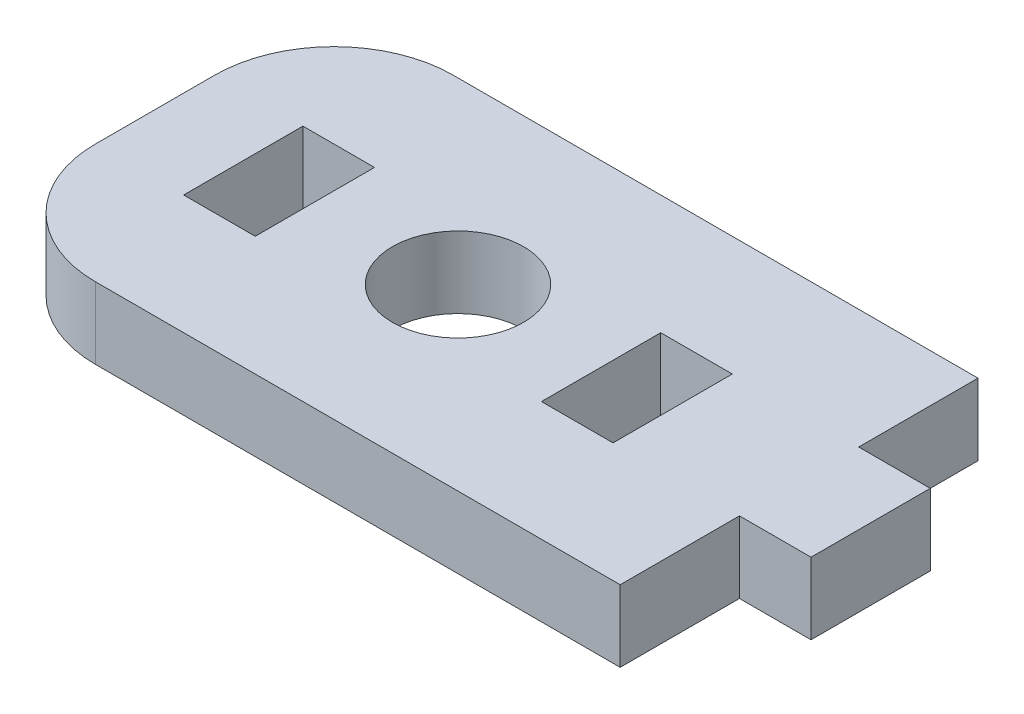
ISO-10303-21;
HEADER;
FILE_DESCRIPTION(('STEP AP214'),'2;1');
FILE_NAME('part.step','',(''),(''),'','','');
FILE_SCHEMA(('AUTOMOTIVE_DESIGN { 1 0 10303 214 1 1 1 1 }'));
ENDSEC;
DATA;
#1=APPLICATION_CONTEXT('core data for automotive mechanical design processes');
#2=APPLICATION_PROTOCOL_DEFINITION('international standard','automotive_design',2000,#1);
#3=PRODUCT_CONTEXT('',#1,'mechanical');
#4=PRODUCT('Part','Part','',(#3));
#5=PRODUCT_RELATED_PRODUCT_CATEGORY('part','',(#4));
#6=PRODUCT_DEFINITION_FORMATION('','',#4);
#7=PRODUCT_DEFINITION_CONTEXT('part definition',#1,'design');
#8=PRODUCT_DEFINITION('design','',#6,#7);
#9=PRODUCT_DEFINITION_SHAPE('','',#8);
#10=(LENGTH_UNIT() NAMED_UNIT(*) SI_UNIT(.MILLI.,.METRE.));
#11=(NAMED_UNIT(*) PLANE_ANGLE_UNIT() SI_UNIT($,.RADIAN.));
#12=(NAMED_UNIT(*) SI_UNIT($,.STERADIAN.) SOLID_ANGLE_UNIT());
#13=UNCERTAINTY_MEASURE_WITH_UNIT(LENGTH_MEASURE(1.E-05),#10,'distance_accuracy_value','');
#14=(GEOMETRIC_REPRESENTATION_CONTEXT(3) GLOBAL_UNCERTAINTY_ASSIGNED_CONTEXT((#13)) GLOBAL_UNIT_ASSIGNED_CONTEXT((#10,
#11,#12)) REPRESENTATION_CONTEXT('',''));
#15=CARTESIAN_POINT('',(0.,0.,0.));
#16=DIRECTION('',(0.,0.,1.));
#17=DIRECTION('',(1.,0.,0.));
#18=AXIS2_PLACEMENT_3D('',#15,#16,#17);
#19=CARTESIAN_POINT('',(0.,3.,0.));
#20=DIRECTION('',(0.,-1.,0.));
#21=DIRECTION('',(0.,0.,-1.));
#22=AXIS2_PLACEMENT_3D('',#19,#20,#21);
#23=PLANE('',#22);
#24=CARTESIAN_POINT('',(-9.12159290101671,3.,-2.5));
#25=DIRECTION('',(0.,1.,0.));
#26=DIRECTION('',(0.,0.,1.));
#27=AXIS2_PLACEMENT_3D('',#24,#25,#26);
#28=CIRCLE('',#27,2.75);
#29=CARTESIAN_POINT('',(-9.12159290101671,3.,0.249999999999998));
#30=VERTEX_POINT('',#29);
#31=EDGE_CURVE('E202',#30,#30,#28,.T.);
#32=ORIENTED_EDGE('',*,*,#31,.F.);
#33=EDGE_LOOP('',(#32));
#34=FACE_BOUND('',#33,.T.);
#35=DIRECTION('',(0.,0.,1.));
#36=VECTOR('',#35,1.);
#37=CARTESIAN_POINT('',(-21.8215929010167,3.,5.));
#38=LINE('',#37,#36);
#39=CARTESIAN_POINT('',(-21.8215929010167,3.,-5.));
#40=VERTEX_POINT('',#39);
#41=CARTESIAN_POINT('',(-21.8215929010167,3.,0.));
#42=VERTEX_POINT('',#41);
#43=EDGE_CURVE('E254',#40,#42,#38,.T.);
#44=ORIENTED_EDGE('',*,*,#43,.T.);
#45=CARTESIAN_POINT('',(-16.8215929010167,3.,0.));
#46=DIRECTION('',(0.,-1.,0.));
#47=DIRECTION('',(0.,0.,-1.));
#48=AXIS2_PLACEMENT_3D('',#45,#46,#47);
#49=CIRCLE('',#48,5.);
#50=CARTESIAN_POINT('',(-16.8215929010167,3.,5.));
#51=VERTEX_POINT('',#50);
#52=EDGE_CURVE('E41',#42,#51,#49,.F.);
#53=ORIENTED_EDGE('',*,*,#52,.T.);
#54=DIRECTION('',(1.,0.,0.));
#55=VECTOR('',#54,1.);
#56=CARTESIAN_POINT('',(5.17840709898329,3.,5.));
#57=LINE('',#56,#55);
#58=CARTESIAN_POINT('',(5.17840709898329,3.,5.));
#59=VERTEX_POINT('',#58);
#60=EDGE_CURVE('E239',#51,#59,#57,.T.);
#61=ORIENTED_EDGE('',*,*,#60,.T.);
#62=DIRECTION('',(0.,0.,-1.));
#63=VECTOR('',#62,1.);
#64=CARTESIAN_POINT('',(5.17840709898329,3.,0.));
#65=LINE('',#64,#63);
#66=CARTESIAN_POINT('',(5.17840709898329,3.,0.));
#67=VERTEX_POINT('',#66);
#68=EDGE_CURVE('E241',#59,#67,#65,.T.);
#69=ORIENTED_EDGE('',*,*,#68,.T.);
#70=DIRECTION('',(1.,0.,0.));
#71=VECTOR('',#70,1.);
#72=CARTESIAN_POINT('',(8.17840709898329,3.,0.));
#73=LINE('',#72,#71);
#74=CARTESIAN_POINT('',(8.17840709898329,3.,0.));
#75=VERTEX_POINT('',#74);
#76=EDGE_CURVE('E244',#67,#75,#73,.T.);
#77=ORIENTED_EDGE('',*,*,#76,.T.);
#78=DIRECTION('',(0.,0.,-1.));
#79=VECTOR('',#78,1.);
#80=CARTESIAN_POINT('',(8.17840709898329,3.,-5.));
#81=LINE('',#80,#79);
#82=CARTESIAN_POINT('',(8.17840709898329,3.,-5.));
#83=VERTEX_POINT('',#82);
#84=EDGE_CURVE('E246',#75,#83,#81,.T.);
#85=ORIENTED_EDGE('',*,*,#84,.T.);
#86=DIRECTION('',(-1.,0.,0.));
#87=VECTOR('',#86,1.);
#88=CARTESIAN_POINT('',(5.17840709898329,3.,-5.));
#89=LINE('',#88,#87);
#90=CARTESIAN_POINT('',(5.17840709898329,3.,-5.));
#91=VERTEX_POINT('',#90);
#92=EDGE_CURVE('E248',#83,#91,#89,.T.);
#93=ORIENTED_EDGE('',*,*,#92,.T.);
#94=DIRECTION('',(0.,0.,-1.));
#95=VECTOR('',#94,1.);
#96=CARTESIAN_POINT('',(5.17840709898329,3.,-10.));
#97=LINE('',#96,#95);
#98=CARTESIAN_POINT('',(5.17840709898329,3.,-10.));
#99=VERTEX_POINT('',#98);
#100=EDGE_CURVE('E250',#91,#99,#97,.T.);
#101=ORIENTED_EDGE('',*,*,#100,.T.);
#102=DIRECTION('',(-1.,0.,0.));
#103=VECTOR('',#102,1.);
#104=CARTESIAN_POINT('',(-21.8215929010167,3.,-10.));
#105=LINE('',#104,#103);
#106=CARTESIAN_POINT('',(-16.8215929010167,3.,-10.));
#107=VERTEX_POINT('',#106);
#108=EDGE_CURVE('E252',#99,#107,#105,.T.);
#109=ORIENTED_EDGE('',*,*,#108,.T.);
#110=CARTESIAN_POINT('',(-16.8215929010167,3.,-5.));
#111=DIRECTION('',(0.,-1.,0.));
#112=DIRECTION('',(0.,0.,-1.));
#113=AXIS2_PLACEMENT_3D('',#110,#111,#112);
#114=CIRCLE('',#113,5.);
#115=EDGE_CURVE('E299',#107,#40,#114,.F.);
#116=ORIENTED_EDGE('',*,*,#115,.T.);
#117=EDGE_LOOP('',(#44,#53,#61,#69,#77,#85,#93,#101,#109,#116));
#118=FACE_BOUND('',#117,.T.);
#119=DIRECTION('',(0.,0.,1.));
#120=VECTOR('',#119,1.);
#121=CARTESIAN_POINT('',(-18.1215929010167,3.,-5.));
#122=LINE('',#121,#120);
#123=CARTESIAN_POINT('',(-18.1215929010167,3.,-5.));
#124=VERTEX_POINT('',#123);
#125=CARTESIAN_POINT('',(-18.1215929010167,3.,0.));
#126=VERTEX_POINT('',#125);
#127=EDGE_CURVE('E208',#124,#126,#122,.T.);
#128=ORIENTED_EDGE('',*,*,#127,.F.);
#129=DIRECTION('',(-1.,0.,0.));
#130=VECTOR('',#129,1.);
#131=CARTESIAN_POINT('',(-15.1215929010167,3.,-5.));
#132=LINE('',#131,#130);
#133=CARTESIAN_POINT('',(-15.1215929010167,3.,-5.));
#134=VERTEX_POINT('',#133);
#135=EDGE_CURVE('E216',#134,#124,#132,.T.);
#136=ORIENTED_EDGE('',*,*,#135,.F.);
#137=DIRECTION('',(0.,0.,-1.));
#138=VECTOR('',#137,1.);
#139=CARTESIAN_POINT('',(-15.1215929010167,3.,-5.));
#140=LINE('',#139,#138);
#141=CARTESIAN_POINT('',(-15.1215929010167,3.,0.));
#142=VERTEX_POINT('',#141);
#143=EDGE_CURVE('E213',#142,#134,#140,.T.);
#144=ORIENTED_EDGE('',*,*,#143,.F.);
#145=DIRECTION('',(1.,0.,0.));
#146=VECTOR('',#145,1.);
#147=CARTESIAN_POINT('',(-15.1215929010167,3.,0.));
#148=LINE('',#147,#146);
#149=EDGE_CURVE('E210',#126,#142,#148,.T.);
#150=ORIENTED_EDGE('',*,*,#149,.F.);
#151=EDGE_LOOP('',(#128,#136,#144,#150));
#152=FACE_BOUND('',#151,.T.);
#153=DIRECTION('',(0.,0.,1.));
#154=VECTOR('',#153,1.);
#155=CARTESIAN_POINT('',(-3.12159290101671,3.,-5.));
#156=LINE('',#155,#154);
#157=CARTESIAN_POINT('',(-3.12159290101671,3.,-5.));
#158=VERTEX_POINT('',#157);
#159=CARTESIAN_POINT('',(-3.12159290101671,3.,0.));
#160=VERTEX_POINT('',#159);
#161=EDGE_CURVE('E161',#158,#160,#156,.T.);
#162=ORIENTED_EDGE('',*,*,#161,.F.);
#163=DIRECTION('',(-1.,0.,0.));
#164=VECTOR('',#163,1.);
#165=CARTESIAN_POINT('',(-3.12159290101671,3.,-5.));
#166=LINE('',#165,#164);
#167=CARTESIAN_POINT('',(-0.121592901016709,3.,-5.));
#168=VERTEX_POINT('',#167);
#169=EDGE_CURVE('E186',#168,#158,#166,.T.);
#170=ORIENTED_EDGE('',*,*,#169,.F.);
#171=DIRECTION('',(0.,0.,-1.));
#172=VECTOR('',#171,1.);
#173=CARTESIAN_POINT('',(-0.121592901016709,3.,-5.));
#174=LINE('',#173,#172);
#175=CARTESIAN_POINT('',(-0.121592901016709,3.,0.));
#176=VERTEX_POINT('',#175);
#177=EDGE_CURVE('E184',#176,#168,#174,.T.);
#178=ORIENTED_EDGE('',*,*,#177,.F.);
#179=DIRECTION('',(1.,0.,0.));
#180=VECTOR('',#179,1.);
#181=CARTESIAN_POINT('',(-3.12159290101671,3.,0.));
#182=LINE('',#181,#180);
#183=EDGE_CURVE('E171',#160,#176,#182,.T.);
#184=ORIENTED_EDGE('',*,*,#183,.F.);
#185=EDGE_LOOP('',(#162,#170,#178,#184));
#186=FACE_BOUND('',#185,.T.);
#187=ADVANCED_FACE('F33',(#34,#118,#152,#186),#23,.F.);
#188=CARTESIAN_POINT('',(0.,0.,0.));
#189=DIRECTION('',(0.,-1.,0.));
#190=DIRECTION('',(0.,0.,-1.));
#191=AXIS2_PLACEMENT_3D('',#188,#189,#190);
#192=PLANE('',#191);
#193=CARTESIAN_POINT('',(-9.12159290101671,0.,-2.5));
#194=DIRECTION('',(0.,1.,0.));
#195=DIRECTION('',(0.,0.,1.));
#196=AXIS2_PLACEMENT_3D('',#193,#194,#195);
#197=CIRCLE('',#196,2.75);
#198=CARTESIAN_POINT('',(-9.12159290101671,0.,0.249999999999998));
#199=VERTEX_POINT('',#198);
#200=EDGE_CURVE('E179',#199,#199,#197,.T.);
#201=ORIENTED_EDGE('',*,*,#200,.T.);
#202=EDGE_LOOP('',(#201));
#203=FACE_BOUND('',#202,.T.);
#204=DIRECTION('',(1.,0.,0.));
#205=VECTOR('',#204,1.);
#206=CARTESIAN_POINT('',(5.17840709898329,0.,5.));
#207=LINE('',#206,#205);
#208=CARTESIAN_POINT('',(-16.8215929010167,0.,5.));
#209=VERTEX_POINT('',#208);
#210=CARTESIAN_POINT('',(5.17840709898329,0.,5.));
#211=VERTEX_POINT('',#210);
#212=EDGE_CURVE('E238',#209,#211,#207,.T.);
#213=ORIENTED_EDGE('',*,*,#212,.F.);
#214=CARTESIAN_POINT('',(-16.8215929010167,0.,0.));
#215=DIRECTION('',(0.,-1.,0.));
#216=DIRECTION('',(0.,0.,-1.));
#217=AXIS2_PLACEMENT_3D('',#214,#215,#216);
#218=CIRCLE('',#217,5.);
#219=CARTESIAN_POINT('',(-21.8215929010167,0.,0.));
#220=VERTEX_POINT('',#219);
#221=EDGE_CURVE('E293',#209,#220,#218,.T.);
#222=ORIENTED_EDGE('',*,*,#221,.T.);
#223=DIRECTION('',(0.,0.,1.));
#224=VECTOR('',#223,1.);
#225=CARTESIAN_POINT('',(-21.8215929010167,0.,5.));
#226=LINE('',#225,#224);
#227=CARTESIAN_POINT('',(-21.8215929010167,0.,-5.));
#228=VERTEX_POINT('',#227);
#229=EDGE_CURVE('E242',#228,#220,#226,.T.);
#230=ORIENTED_EDGE('',*,*,#229,.F.);
#231=CARTESIAN_POINT('',(-16.8215929010167,0.,-5.));
#232=DIRECTION('',(0.,-1.,0.));
#233=DIRECTION('',(0.,0.,-1.));
#234=AXIS2_PLACEMENT_3D('',#231,#232,#233);
#235=CIRCLE('',#234,5.);
#236=CARTESIAN_POINT('',(-16.8215929010167,0.,-10.));
#237=VERTEX_POINT('',#236);
#238=EDGE_CURVE('E291',#228,#237,#235,.T.);
#239=ORIENTED_EDGE('',*,*,#238,.T.);
#240=DIRECTION('',(-1.,0.,0.));
#241=VECTOR('',#240,1.);
#242=CARTESIAN_POINT('',(-21.8215929010167,0.,-10.));
#243=LINE('',#242,#241);
#244=CARTESIAN_POINT('',(5.17840709898329,0.,-10.));
#245=VERTEX_POINT('',#244);
#246=EDGE_CURVE('E268',#245,#237,#243,.T.);
#247=ORIENTED_EDGE('',*,*,#246,.F.);
#248=DIRECTION('',(0.,0.,-1.));
#249=VECTOR('',#248,1.);
#250=CARTESIAN_POINT('',(5.17840709898329,0.,-10.));
#251=LINE('',#250,#249);
#252=CARTESIAN_POINT('',(5.17840709898329,0.,-5.));
#253=VERTEX_POINT('',#252);
#254=EDGE_CURVE('E266',#253,#245,#251,.T.);
#255=ORIENTED_EDGE('',*,*,#254,.F.);
#256=DIRECTION('',(-1.,0.,0.));
#257=VECTOR('',#256,1.);
#258=CARTESIAN_POINT('',(5.17840709898329,0.,-5.));
#259=LINE('',#258,#257);
#260=CARTESIAN_POINT('',(8.17840709898329,0.,-5.));
#261=VERTEX_POINT('',#260);
#262=EDGE_CURVE('E264',#261,#253,#259,.T.);
#263=ORIENTED_EDGE('',*,*,#262,.F.);
#264=DIRECTION('',(0.,0.,-1.));
#265=VECTOR('',#264,1.);
#266=CARTESIAN_POINT('',(8.17840709898329,0.,-5.));
#267=LINE('',#266,#265);
#268=CARTESIAN_POINT('',(8.17840709898329,0.,0.));
#269=VERTEX_POINT('',#268);
#270=EDGE_CURVE('E262',#269,#261,#267,.T.);
#271=ORIENTED_EDGE('',*,*,#270,.F.);
#272=DIRECTION('',(1.,0.,0.));
#273=VECTOR('',#272,1.);
#274=CARTESIAN_POINT('',(8.17840709898329,0.,0.));
#275=LINE('',#274,#273);
#276=CARTESIAN_POINT('',(5.17840709898329,0.,0.));
#277=VERTEX_POINT('',#276);
#278=EDGE_CURVE('E260',#277,#269,#275,.T.);
#279=ORIENTED_EDGE('',*,*,#278,.F.);
#280=DIRECTION('',(0.,0.,-1.));
#281=VECTOR('',#280,1.);
#282=CARTESIAN_POINT('',(5.17840709898329,0.,0.));
#283=LINE('',#282,#281);
#284=EDGE_CURVE('E258',#211,#277,#283,.T.);
#285=ORIENTED_EDGE('',*,*,#284,.F.);
#286=EDGE_LOOP('',(#213,#222,#230,#239,#247,#255,#263,#271,#279,#285));
#287=FACE_BOUND('',#286,.T.);
#288=DIRECTION('',(-1.,0.,0.));
#289=VECTOR('',#288,1.);
#290=CARTESIAN_POINT('',(-15.1215929010167,0.,-5.));
#291=LINE('',#290,#289);
#292=CARTESIAN_POINT('',(-15.1215929010167,0.,-5.));
#293=VERTEX_POINT('',#292);
#294=CARTESIAN_POINT('',(-18.1215929010167,0.,-5.));
#295=VERTEX_POINT('',#294);
#296=EDGE_CURVE('E211',#293,#295,#291,.T.);
#297=ORIENTED_EDGE('',*,*,#296,.T.);
#298=DIRECTION('',(0.,0.,1.));
#299=VECTOR('',#298,1.);
#300=CARTESIAN_POINT('',(-18.1215929010167,0.,-5.));
#301=LINE('',#300,#299);
#302=CARTESIAN_POINT('',(-18.1215929010167,0.,0.));
#303=VERTEX_POINT('',#302);
#304=EDGE_CURVE('E205',#295,#303,#301,.T.);
#305=ORIENTED_EDGE('',*,*,#304,.T.);
#306=DIRECTION('',(1.,0.,0.));
#307=VECTOR('',#306,1.);
#308=CARTESIAN_POINT('',(-15.1215929010167,0.,0.));
#309=LINE('',#308,#307);
#310=CARTESIAN_POINT('',(-15.1215929010167,0.,0.));
#311=VERTEX_POINT('',#310);
#312=EDGE_CURVE('E221',#303,#311,#309,.T.);
#313=ORIENTED_EDGE('',*,*,#312,.T.);
#314=DIRECTION('',(0.,0.,-1.));
#315=VECTOR('',#314,1.);
#316=CARTESIAN_POINT('',(-15.1215929010167,0.,-5.));
#317=LINE('',#316,#315);
#318=EDGE_CURVE('E224',#311,#293,#317,.T.);
#319=ORIENTED_EDGE('',*,*,#318,.T.);
#320=EDGE_LOOP('',(#297,#305,#313,#319));
#321=FACE_BOUND('',#320,.T.);
#322=DIRECTION('',(-1.,0.,0.));
#323=VECTOR('',#322,1.);
#324=CARTESIAN_POINT('',(-3.12159290101671,0.,-5.));
#325=LINE('',#324,#323);
#326=CARTESIAN_POINT('',(-0.121592901016709,0.,-5.));
#327=VERTEX_POINT('',#326);
#328=CARTESIAN_POINT('',(-3.12159290101671,0.,-5.));
#329=VERTEX_POINT('',#328);
#330=EDGE_CURVE('E172',#327,#329,#325,.T.);
#331=ORIENTED_EDGE('',*,*,#330,.T.);
#332=DIRECTION('',(0.,0.,1.));
#333=VECTOR('',#332,1.);
#334=CARTESIAN_POINT('',(-3.12159290101671,0.,-5.));
#335=LINE('',#334,#333);
#336=CARTESIAN_POINT('',(-3.12159290101671,0.,0.));
#337=VERTEX_POINT('',#336);
#338=EDGE_CURVE('E190',#329,#337,#335,.T.);
#339=ORIENTED_EDGE('',*,*,#338,.T.);
#340=DIRECTION('',(1.,0.,0.));
#341=VECTOR('',#340,1.);
#342=CARTESIAN_POINT('',(-3.12159290101671,0.,0.));
#343=LINE('',#342,#341);
#344=CARTESIAN_POINT('',(-0.121592901016709,0.,0.));
#345=VERTEX_POINT('',#344);
#346=EDGE_CURVE('E178',#337,#345,#343,.T.);
#347=ORIENTED_EDGE('',*,*,#346,.T.);
#348=DIRECTION('',(0.,0.,-1.));
#349=VECTOR('',#348,1.);
#350=CARTESIAN_POINT('',(-0.121592901016709,0.,-5.));
#351=LINE('',#350,#349);
#352=EDGE_CURVE('E193',#345,#327,#351,.T.);
#353=ORIENTED_EDGE('',*,*,#352,.T.);
#354=EDGE_LOOP('',(#331,#339,#347,#353));
#355=FACE_BOUND('',#354,.T.);
#356=ADVANCED_FACE('F314',(#203,#287,#321,#355),#192,.T.);
#357=CARTESIAN_POINT('',(5.17840709898329,3.,5.));
#358=DIRECTION('',(0.,0.,-1.));
#359=DIRECTION('',(-1.,0.,0.));
#360=AXIS2_PLACEMENT_3D('',#357,#358,#359);
#361=PLANE('',#360);
#362=ORIENTED_EDGE('',*,*,#60,.F.);
#363=DIRECTION('',(0.,-1.,0.));
#364=VECTOR('',#363,1.);
#365=CARTESIAN_POINT('',(-16.8215929010167,3.,5.));
#366=LINE('',#365,#364);
#367=EDGE_CURVE('E288',#51,#209,#366,.T.);
#368=ORIENTED_EDGE('',*,*,#367,.T.);
#369=ORIENTED_EDGE('',*,*,#212,.T.);
#370=DIRECTION('',(0.,-1.,0.));
#371=VECTOR('',#370,1.);
#372=CARTESIAN_POINT('',(5.17840709898329,3.,5.));
#373=LINE('',#372,#371);
#374=EDGE_CURVE('E285',#59,#211,#373,.T.);
#375=ORIENTED_EDGE('',*,*,#374,.F.);
#376=EDGE_LOOP('',(#362,#368,#369,#375));
#377=FACE_BOUND('',#376,.T.);
#378=ADVANCED_FACE('F309',(#377),#361,.F.);
#379=CARTESIAN_POINT('',(5.17840709898329,3.,0.));
#380=DIRECTION('',(-1.,0.,0.));
#381=DIRECTION('',(0.,0.,1.));
#382=AXIS2_PLACEMENT_3D('',#379,#380,#381);
#383=PLANE('',#382);
#384=ORIENTED_EDGE('',*,*,#284,.T.);
#385=DIRECTION('',(0.,-1.,0.));
#386=VECTOR('',#385,1.);
#387=CARTESIAN_POINT('',(5.17840709898329,3.,0.));
#388=LINE('',#387,#386);
#389=EDGE_CURVE('E282',#67,#277,#388,.T.);
#390=ORIENTED_EDGE('',*,*,#389,.F.);
#391=ORIENTED_EDGE('',*,*,#68,.F.);
#392=ORIENTED_EDGE('',*,*,#374,.T.);
#393=EDGE_LOOP('',(#384,#390,#391,#392));
#394=FACE_BOUND('',#393,.T.);
#395=ADVANCED_FACE('F345',(#394),#383,.F.);
#396=CARTESIAN_POINT('',(8.17840709898329,3.,0.));
#397=DIRECTION('',(0.,0.,-1.));
#398=DIRECTION('',(-1.,0.,0.));
#399=AXIS2_PLACEMENT_3D('',#396,#397,#398);
#400=PLANE('',#399);
#401=ORIENTED_EDGE('',*,*,#278,.T.);
#402=DIRECTION('',(0.,-1.,0.));
#403=VECTOR('',#402,1.);
#404=CARTESIAN_POINT('',(8.17840709898329,3.,0.));
#405=LINE('',#404,#403);
#406=EDGE_CURVE('E279',#75,#269,#405,.T.);
#407=ORIENTED_EDGE('',*,*,#406,.F.);
#408=ORIENTED_EDGE('',*,*,#76,.F.);
#409=ORIENTED_EDGE('',*,*,#389,.T.);
#410=EDGE_LOOP('',(#401,#407,#408,#409));
#411=FACE_BOUND('',#410,.T.);
#412=ADVANCED_FACE('F342',(#411),#400,.F.);
#413=CARTESIAN_POINT('',(8.17840709898329,3.,-5.));
#414=DIRECTION('',(-1.,0.,0.));
#415=DIRECTION('',(0.,0.,1.));
#416=AXIS2_PLACEMENT_3D('',#413,#414,#415);
#417=PLANE('',#416);
#418=ORIENTED_EDGE('',*,*,#270,.T.);
#419=DIRECTION('',(0.,-1.,0.));
#420=VECTOR('',#419,1.);
#421=CARTESIAN_POINT('',(8.17840709898329,3.,-5.));
#422=LINE('',#421,#420);
#423=EDGE_CURVE('E276',#83,#261,#422,.T.);
#424=ORIENTED_EDGE('',*,*,#423,.F.);
#425=ORIENTED_EDGE('',*,*,#84,.F.);
#426=ORIENTED_EDGE('',*,*,#406,.T.);
#427=EDGE_LOOP('',(#418,#424,#425,#426));
#428=FACE_BOUND('',#427,.T.);
#429=ADVANCED_FACE('F338',(#428),#417,.F.);
#430=CARTESIAN_POINT('',(5.17840709898329,3.,-5.));
#431=DIRECTION('',(0.,0.,1.));
#432=DIRECTION('',(1.,0.,0.));
#433=AXIS2_PLACEMENT_3D('',#430,#431,#432);
#434=PLANE('',#433);
#435=ORIENTED_EDGE('',*,*,#262,.T.);
#436=DIRECTION('',(0.,-1.,0.));
#437=VECTOR('',#436,1.);
#438=CARTESIAN_POINT('',(5.17840709898329,3.,-5.));
#439=LINE('',#438,#437);
#440=EDGE_CURVE('E273',#91,#253,#439,.T.);
#441=ORIENTED_EDGE('',*,*,#440,.F.);
#442=ORIENTED_EDGE('',*,*,#92,.F.);
#443=ORIENTED_EDGE('',*,*,#423,.T.);
#444=EDGE_LOOP('',(#435,#441,#442,#443));
#445=FACE_BOUND('',#444,.T.);
#446=ADVANCED_FACE('F333',(#445),#434,.F.);
#447=CARTESIAN_POINT('',(5.17840709898329,3.,-10.));
#448=DIRECTION('',(-1.,0.,0.));
#449=DIRECTION('',(0.,0.,1.));
#450=AXIS2_PLACEMENT_3D('',#447,#448,#449);
#451=PLANE('',#450);
#452=ORIENTED_EDGE('',*,*,#254,.T.);
#453=DIRECTION('',(0.,-1.,0.));
#454=VECTOR('',#453,1.);
#455=CARTESIAN_POINT('',(5.17840709898329,3.,-10.));
#456=LINE('',#455,#454);
#457=EDGE_CURVE('E256',#99,#245,#456,.T.);
#458=ORIENTED_EDGE('',*,*,#457,.F.);
#459=ORIENTED_EDGE('',*,*,#100,.F.);
#460=ORIENTED_EDGE('',*,*,#440,.T.);
#461=EDGE_LOOP('',(#452,#458,#459,#460));
#462=FACE_BOUND('',#461,.T.);
#463=ADVANCED_FACE('F327',(#462),#451,.F.);
#464=CARTESIAN_POINT('',(-21.8215929010167,3.,-10.));
#465=DIRECTION('',(0.,0.,1.));
#466=DIRECTION('',(1.,0.,0.));
#467=AXIS2_PLACEMENT_3D('',#464,#465,#466);
#468=PLANE('',#467);
#469=ORIENTED_EDGE('',*,*,#246,.T.);
#470=DIRECTION('',(0.,-1.,0.));
#471=VECTOR('',#470,1.);
#472=CARTESIAN_POINT('',(-16.8215929010167,3.,-10.));
#473=LINE('',#472,#471);
#474=EDGE_CURVE('E11',#237,#107,#473,.F.);
#475=ORIENTED_EDGE('',*,*,#474,.T.);
#476=ORIENTED_EDGE('',*,*,#108,.F.);
#477=ORIENTED_EDGE('',*,*,#457,.T.);
#478=EDGE_LOOP('',(#469,#475,#476,#477));
#479=FACE_BOUND('',#478,.T.);
#480=ADVANCED_FACE('F323',(#479),#468,.F.);
#481=CARTESIAN_POINT('',(-21.8215929010167,3.,5.));
#482=DIRECTION('',(1.,0.,0.));
#483=DIRECTION('',(0.,0.,-1.));
#484=AXIS2_PLACEMENT_3D('',#481,#482,#483);
#485=PLANE('',#484);
#486=ORIENTED_EDGE('',*,*,#229,.T.);
#487=DIRECTION('',(0.,-1.,0.));
#488=VECTOR('',#487,1.);
#489=CARTESIAN_POINT('',(-21.8215929010167,3.,0.));
#490=LINE('',#489,#488);
#491=EDGE_CURVE('E54',#220,#42,#490,.F.);
#492=ORIENTED_EDGE('',*,*,#491,.T.);
#493=ORIENTED_EDGE('',*,*,#43,.F.);
#494=DIRECTION('',(0.,-1.,0.));
#495=VECTOR('',#494,1.);
#496=CARTESIAN_POINT('',(-21.8215929010167,3.,-5.));
#497=LINE('',#496,#495);
#498=EDGE_CURVE('E295',#40,#228,#497,.T.);
#499=ORIENTED_EDGE('',*,*,#498,.T.);
#500=EDGE_LOOP('',(#486,#492,#493,#499));
#501=FACE_BOUND('',#500,.T.);
#502=ADVANCED_FACE('F317',(#501),#485,.F.);
#503=CARTESIAN_POINT('',(-18.1215929010167,3.,-5.));
#504=DIRECTION('',(1.,0.,0.));
#505=DIRECTION('',(0.,0.,-1.));
#506=AXIS2_PLACEMENT_3D('',#503,#504,#505);
#507=PLANE('',#506);
#508=ORIENTED_EDGE('',*,*,#304,.F.);
#509=DIRECTION('',(0.,-1.,0.));
#510=VECTOR('',#509,1.);
#511=CARTESIAN_POINT('',(-18.1215929010167,3.,-5.));
#512=LINE('',#511,#510);
#513=EDGE_CURVE('E218',#124,#295,#512,.T.);
#514=ORIENTED_EDGE('',*,*,#513,.F.);
#515=ORIENTED_EDGE('',*,*,#127,.T.);
#516=DIRECTION('',(0.,-1.,0.));
#517=VECTOR('',#516,1.);
#518=CARTESIAN_POINT('',(-18.1215929010167,3.,0.));
#519=LINE('',#518,#517);
#520=EDGE_CURVE('E235',#126,#303,#519,.T.);
#521=ORIENTED_EDGE('',*,*,#520,.T.);
#522=EDGE_LOOP('',(#508,#514,#515,#521));
#523=FACE_BOUND('',#522,.T.);
#524=ADVANCED_FACE('F364',(#523),#507,.T.);
#525=CARTESIAN_POINT('',(-15.1215929010167,3.,0.));
#526=DIRECTION('',(0.,0.,-1.));
#527=DIRECTION('',(-1.,0.,0.));
#528=AXIS2_PLACEMENT_3D('',#525,#526,#527);
#529=PLANE('',#528);
#530=ORIENTED_EDGE('',*,*,#312,.F.);
#531=ORIENTED_EDGE('',*,*,#520,.F.);
#532=ORIENTED_EDGE('',*,*,#149,.T.);
#533=DIRECTION('',(0.,-1.,0.));
#534=VECTOR('',#533,1.);
#535=CARTESIAN_POINT('',(-15.1215929010167,3.,0.));
#536=LINE('',#535,#534);
#537=EDGE_CURVE('E233',#142,#311,#536,.T.);
#538=ORIENTED_EDGE('',*,*,#537,.T.);
#539=EDGE_LOOP('',(#530,#531,#532,#538));
#540=FACE_BOUND('',#539,.T.);
#541=ADVANCED_FACE('F404',(#540),#529,.T.);
#542=CARTESIAN_POINT('',(-15.1215929010167,3.,-5.));
#543=DIRECTION('',(-1.,0.,0.));
#544=DIRECTION('',(0.,0.,1.));
#545=AXIS2_PLACEMENT_3D('',#542,#543,#544);
#546=PLANE('',#545);
#547=ORIENTED_EDGE('',*,*,#318,.F.);
#548=ORIENTED_EDGE('',*,*,#537,.F.);
#549=ORIENTED_EDGE('',*,*,#143,.T.);
#550=DIRECTION('',(0.,-1.,0.));
#551=VECTOR('',#550,1.);
#552=CARTESIAN_POINT('',(-15.1215929010167,3.,-5.));
#553=LINE('',#552,#551);
#554=EDGE_CURVE('E231',#134,#293,#553,.T.);
#555=ORIENTED_EDGE('',*,*,#554,.T.);
#556=EDGE_LOOP('',(#547,#548,#549,#555));
#557=FACE_BOUND('',#556,.T.);
#558=ADVANCED_FACE('F411',(#557),#546,.T.);
#559=CARTESIAN_POINT('',(-15.1215929010167,3.,-5.));
#560=DIRECTION('',(0.,0.,1.));
#561=DIRECTION('',(1.,0.,0.));
#562=AXIS2_PLACEMENT_3D('',#559,#560,#561);
#563=PLANE('',#562);
#564=ORIENTED_EDGE('',*,*,#296,.F.);
#565=ORIENTED_EDGE('',*,*,#554,.F.);
#566=ORIENTED_EDGE('',*,*,#135,.T.);
#567=ORIENTED_EDGE('',*,*,#513,.T.);
#568=EDGE_LOOP('',(#564,#565,#566,#567));
#569=FACE_BOUND('',#568,.T.);
#570=ADVANCED_FACE('F418',(#569),#563,.T.);
#571=CARTESIAN_POINT('',(-9.12159290101671,3.,-2.5));
#572=DIRECTION('',(0.,-1.,0.));
#573=DIRECTION('',(0.,0.,-1.));
#574=AXIS2_PLACEMENT_3D('',#571,#572,#573);
#575=CYLINDRICAL_SURFACE('',#574,2.75);
#576=ORIENTED_EDGE('',*,*,#31,.T.);
#577=EDGE_LOOP('',(#576));
#578=FACE_BOUND('',#577,.T.);
#579=ORIENTED_EDGE('',*,*,#200,.F.);
#580=EDGE_LOOP('',(#579));
#581=FACE_BOUND('',#580,.T.);
#582=ADVANCED_FACE('F426',(#578,#581),#575,.F.);
#583=CARTESIAN_POINT('',(-3.12159290101671,3.,-5.));
#584=DIRECTION('',(1.,0.,0.));
#585=DIRECTION('',(0.,0.,-1.));
#586=AXIS2_PLACEMENT_3D('',#583,#584,#585);
#587=PLANE('',#586);
#588=ORIENTED_EDGE('',*,*,#338,.F.);
#589=DIRECTION('',(0.,-1.,0.));
#590=VECTOR('',#589,1.);
#591=CARTESIAN_POINT('',(-3.12159290101671,3.,-5.));
#592=LINE('',#591,#590);
#593=EDGE_CURVE('E167',#158,#329,#592,.T.);
#594=ORIENTED_EDGE('',*,*,#593,.F.);
#595=ORIENTED_EDGE('',*,*,#161,.T.);
#596=DIRECTION('',(0.,-1.,0.));
#597=VECTOR('',#596,1.);
#598=CARTESIAN_POINT('',(-3.12159290101671,3.,0.));
#599=LINE('',#598,#597);
#600=EDGE_CURVE('E164',#160,#337,#599,.T.);
#601=ORIENTED_EDGE('',*,*,#600,.T.);
#602=EDGE_LOOP('',(#588,#594,#595,#601));
#603=FACE_BOUND('',#602,.T.);
#604=ADVANCED_FACE('F163',(#603),#587,.T.);
#605=CARTESIAN_POINT('',(-3.12159290101671,3.,0.));
#606=DIRECTION('',(0.,0.,-1.));
#607=DIRECTION('',(-1.,0.,0.));
#608=AXIS2_PLACEMENT_3D('',#605,#606,#607);
#609=PLANE('',#608);
#610=ORIENTED_EDGE('',*,*,#346,.F.);
#611=ORIENTED_EDGE('',*,*,#600,.F.);
#612=ORIENTED_EDGE('',*,*,#183,.T.);
#613=DIRECTION('',(0.,-1.,0.));
#614=VECTOR('',#613,1.);
#615=CARTESIAN_POINT('',(-0.121592901016709,3.,0.));
#616=LINE('',#615,#614);
#617=EDGE_CURVE('E180',#176,#345,#616,.T.);
#618=ORIENTED_EDGE('',*,*,#617,.T.);
#619=EDGE_LOOP('',(#610,#611,#612,#618));
#620=FACE_BOUND('',#619,.T.);
#621=ADVANCED_FACE('F175',(#620),#609,.T.);
#622=CARTESIAN_POINT('',(-0.121592901016709,3.,-5.));
#623=DIRECTION('',(-1.,0.,0.));
#624=DIRECTION('',(0.,0.,1.));
#625=AXIS2_PLACEMENT_3D('',#622,#623,#624);
#626=PLANE('',#625);
#627=ORIENTED_EDGE('',*,*,#352,.F.);
#628=ORIENTED_EDGE('',*,*,#617,.F.);
#629=ORIENTED_EDGE('',*,*,#177,.T.);
#630=DIRECTION('',(0.,-1.,0.));
#631=VECTOR('',#630,1.);
#632=CARTESIAN_POINT('',(-0.121592901016709,3.,-5.));
#633=LINE('',#632,#631);
#634=EDGE_CURVE('E199',#168,#327,#633,.T.);
#635=ORIENTED_EDGE('',*,*,#634,.T.);
#636=EDGE_LOOP('',(#627,#628,#629,#635));
#637=FACE_BOUND('',#636,.T.);
#638=ADVANCED_FACE('F447',(#637),#626,.T.);
#639=CARTESIAN_POINT('',(-3.12159290101671,3.,-5.));
#640=DIRECTION('',(0.,0.,1.));
#641=DIRECTION('',(1.,0.,0.));
#642=AXIS2_PLACEMENT_3D('',#639,#640,#641);
#643=PLANE('',#642);
#644=ORIENTED_EDGE('',*,*,#330,.F.);
#645=ORIENTED_EDGE('',*,*,#634,.F.);
#646=ORIENTED_EDGE('',*,*,#169,.T.);
#647=ORIENTED_EDGE('',*,*,#593,.T.);
#648=EDGE_LOOP('',(#644,#645,#646,#647));
#649=FACE_BOUND('',#648,.T.);
#650=ADVANCED_FACE('F454',(#649),#643,.T.);
#651=CARTESIAN_POINT('',(-16.8215929010167,3.,0.));
#652=DIRECTION('',(0.,-1.,0.));
#653=DIRECTION('',(0.,0.,-1.));
#654=AXIS2_PLACEMENT_3D('',#651,#652,#653);
#655=CYLINDRICAL_SURFACE('',#654,5.);
#656=ORIENTED_EDGE('',*,*,#52,.F.);
#657=ORIENTED_EDGE('',*,*,#491,.F.);
#658=ORIENTED_EDGE('',*,*,#221,.F.);
#659=ORIENTED_EDGE('',*,*,#367,.F.);
#660=EDGE_LOOP('',(#656,#657,#658,#659));
#661=FACE_BOUND('',#660,.T.);
#662=ADVANCED_FACE('F311',(#661),#655,.T.);
#663=CARTESIAN_POINT('',(-16.8215929010167,3.,-5.));
#664=DIRECTION('',(0.,-1.,0.));
#665=DIRECTION('',(0.,0.,-1.));
#666=AXIS2_PLACEMENT_3D('',#663,#664,#665);
#667=CYLINDRICAL_SURFACE('',#666,5.);
#668=ORIENTED_EDGE('',*,*,#115,.F.);
#669=ORIENTED_EDGE('',*,*,#474,.F.);
#670=ORIENTED_EDGE('',*,*,#238,.F.);
#671=ORIENTED_EDGE('',*,*,#498,.F.);
#672=EDGE_LOOP('',(#668,#669,#670,#671));
#673=FACE_BOUND('',#672,.T.);
#674=ADVANCED_FACE('F35',(#673),#667,.T.);
#675=CLOSED_SHELL('',(#187,#356,#378,#395,#412,#429,#446,#463,#480,#502,#524,#541,#558,#570,
#582,#604,#621,#638,#650,#662,#674));
#676=MANIFOLD_SOLID_BREP('B2',#675);
#677=ADVANCED_BREP_SHAPE_REPRESENTATION('',(#18,#676),#14);
#678=SHAPE_DEFINITION_REPRESENTATION(#9,#677);
ENDSEC;
END-ISO-10303-21;
